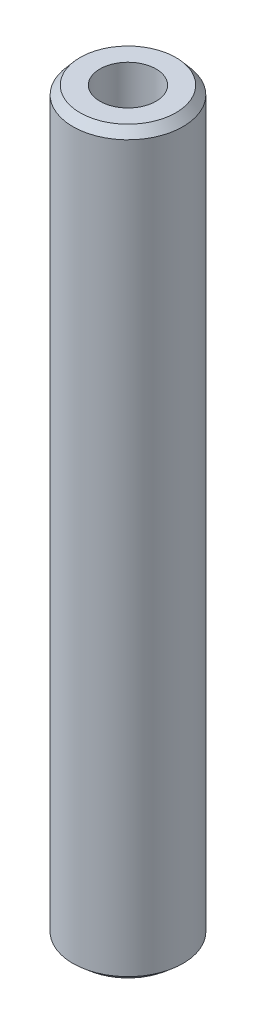
ISO-10303-21;
HEADER;
FILE_DESCRIPTION(('STEP AP214'),'2;1');
FILE_NAME('part.step','',(''),(''),'','','');
FILE_SCHEMA(('AUTOMOTIVE_DESIGN { 1 0 10303 214 1 1 1 1 }'));
ENDSEC;
DATA;
#1=APPLICATION_CONTEXT('core data for automotive mechanical design processes');
#2=APPLICATION_PROTOCOL_DEFINITION('international standard','automotive_design',2000,#1);
#3=PRODUCT_CONTEXT('',#1,'mechanical');
#4=PRODUCT('Part','Part','',(#3));
#5=PRODUCT_RELATED_PRODUCT_CATEGORY('part','',(#4));
#6=PRODUCT_DEFINITION_FORMATION('','',#4);
#7=PRODUCT_DEFINITION_CONTEXT('part definition',#1,'design');
#8=PRODUCT_DEFINITION('design','',#6,#7);
#9=PRODUCT_DEFINITION_SHAPE('','',#8);
#10=(LENGTH_UNIT() NAMED_UNIT(*) SI_UNIT(.MILLI.,.METRE.));
#11=(NAMED_UNIT(*) PLANE_ANGLE_UNIT() SI_UNIT($,.RADIAN.));
#12=(NAMED_UNIT(*) SI_UNIT($,.STERADIAN.) SOLID_ANGLE_UNIT());
#13=UNCERTAINTY_MEASURE_WITH_UNIT(LENGTH_MEASURE(1.E-05),#10,'distance_accuracy_value','');
#14=(GEOMETRIC_REPRESENTATION_CONTEXT(3) GLOBAL_UNCERTAINTY_ASSIGNED_CONTEXT((#13)) GLOBAL_UNIT_ASSIGNED_CONTEXT((#10,
#11,#12)) REPRESENTATION_CONTEXT('',''));
#15=CARTESIAN_POINT('',(0.,0.,0.));
#16=DIRECTION('',(0.,0.,1.));
#17=DIRECTION('',(1.,0.,0.));
#18=AXIS2_PLACEMENT_3D('',#15,#16,#17);
#19=CARTESIAN_POINT('',(0.,302.458994850044,0.));
#20=DIRECTION('',(0.,-1.,0.));
#21=DIRECTION('',(0.,0.,-1.));
#22=AXIS2_PLACEMENT_3D('',#19,#20,#21);
#23=CYLINDRICAL_SURFACE('',#22,22.5);
#24=CARTESIAN_POINT('',(0.,299.00788047226,0.));
#25=DIRECTION('',(0.,1.,0.));
#26=DIRECTION('',(0.,0.,1.));
#27=AXIS2_PLACEMENT_3D('',#24,#25,#26);
#28=CIRCLE('',#27,22.5);
#29=CARTESIAN_POINT('',(0.,299.00788047226,22.5));
#30=VERTEX_POINT('',#29);
#31=EDGE_CURVE('E50',#30,#30,#28,.F.);
#32=ORIENTED_EDGE('',*,*,#31,.T.);
#33=EDGE_LOOP('',(#32));
#34=FACE_BOUND('',#33,.T.);
#35=CARTESIAN_POINT('',(0.,2.92692691111945,0.));
#36=DIRECTION('',(0.,1.,0.));
#37=DIRECTION('',(0.,0.,1.));
#38=AXIS2_PLACEMENT_3D('',#35,#36,#37);
#39=CIRCLE('',#38,22.5);
#40=CARTESIAN_POINT('',(0.,2.92692691111945,22.5));
#41=VERTEX_POINT('',#40);
#42=EDGE_CURVE('E51',#41,#41,#39,.T.);
#43=ORIENTED_EDGE('',*,*,#42,.T.);
#44=EDGE_LOOP('',(#43));
#45=FACE_BOUND('',#44,.T.);
#46=ADVANCED_FACE('F39',(#34,#45),#23,.T.);
#47=CARTESIAN_POINT('',(0.,302.458994850044,0.));
#48=DIRECTION('',(0.,1.,0.));
#49=DIRECTION('',(0.,0.,1.));
#50=AXIS2_PLACEMENT_3D('',#47,#48,#49);
#51=PLANE('',#50);
#52=CARTESIAN_POINT('',(0.,302.458994850044,0.));
#53=DIRECTION('',(0.,1.,0.));
#54=DIRECTION('',(0.,0.,1.));
#55=AXIS2_PLACEMENT_3D('',#52,#53,#54);
#56=CIRCLE('',#55,19.5730730888806);
#57=CARTESIAN_POINT('',(0.,302.458994850044,19.5730730888806));
#58=VERTEX_POINT('',#57);
#59=EDGE_CURVE('E54',#58,#58,#56,.T.);
#60=ORIENTED_EDGE('',*,*,#59,.T.);
#61=EDGE_LOOP('',(#60));
#62=FACE_BOUND('',#61,.T.);
#63=CARTESIAN_POINT('',(0.,302.458994850044,0.));
#64=DIRECTION('',(0.,1.,0.));
#65=DIRECTION('',(0.,0.,1.));
#66=AXIS2_PLACEMENT_3D('',#63,#64,#65);
#67=CIRCLE('',#66,11.4601006637315);
#68=CARTESIAN_POINT('',(0.,302.458994850044,11.4601006637315));
#69=VERTEX_POINT('',#68);
#70=EDGE_CURVE('E58',#69,#69,#67,.T.);
#71=ORIENTED_EDGE('',*,*,#70,.F.);
#72=EDGE_LOOP('',(#71));
#73=FACE_BOUND('',#72,.T.);
#74=ADVANCED_FACE('F69',(#62,#73),#51,.T.);
#75=CARTESIAN_POINT('',(0.,0.,0.));
#76=DIRECTION('',(0.,1.,0.));
#77=DIRECTION('',(0.,0.,1.));
#78=AXIS2_PLACEMENT_3D('',#75,#76,#77);
#79=PLANE('',#78);
#80=CARTESIAN_POINT('',(0.,0.,0.));
#81=DIRECTION('',(0.,1.,0.));
#82=DIRECTION('',(0.,0.,1.));
#83=AXIS2_PLACEMENT_3D('',#80,#81,#82);
#84=CIRCLE('',#83,19.0488856222162);
#85=CARTESIAN_POINT('',(0.,0.,19.0488856222162));
#86=VERTEX_POINT('',#85);
#87=EDGE_CURVE('E10',#86,#86,#84,.F.);
#88=ORIENTED_EDGE('',*,*,#87,.T.);
#89=EDGE_LOOP('',(#88));
#90=FACE_BOUND('',#89,.T.);
#91=CARTESIAN_POINT('',(0.,0.,0.));
#92=DIRECTION('',(0.,1.,0.));
#93=DIRECTION('',(0.,0.,1.));
#94=AXIS2_PLACEMENT_3D('',#91,#92,#93);
#95=CIRCLE('',#94,11.4601006637315);
#96=CARTESIAN_POINT('',(0.,0.,11.4601006637315));
#97=VERTEX_POINT('',#96);
#98=EDGE_CURVE('E63',#97,#97,#95,.T.);
#99=ORIENTED_EDGE('',*,*,#98,.T.);
#100=EDGE_LOOP('',(#99));
#101=FACE_BOUND('',#100,.T.);
#102=ADVANCED_FACE('F75',(#90,#101),#79,.F.);
#103=CARTESIAN_POINT('',(0.,302.458994850044,0.));
#104=DIRECTION('',(0.,-1.,0.));
#105=DIRECTION('',(0.,0.,-1.));
#106=AXIS2_PLACEMENT_3D('',#103,#104,#105);
#107=CYLINDRICAL_SURFACE('',#106,11.4601006637315);
#108=ORIENTED_EDGE('',*,*,#70,.T.);
#109=EDGE_LOOP('',(#108));
#110=FACE_BOUND('',#109,.T.);
#111=ORIENTED_EDGE('',*,*,#98,.F.);
#112=EDGE_LOOP('',(#111));
#113=FACE_BOUND('',#112,.T.);
#114=ADVANCED_FACE('F70',(#110,#113),#107,.F.);
#115=CARTESIAN_POINT('',(0.,302.458994850044,0.));
#116=DIRECTION('',(0.,-1.,0.));
#117=DIRECTION('',(0.,0.,-1.));
#118=AXIS2_PLACEMENT_3D('',#115,#116,#117);
#119=CONICAL_SURFACE('',#118,19.5730730888806,0.703396184985723);
#120=ORIENTED_EDGE('',*,*,#31,.F.);
#121=EDGE_LOOP('',(#120));
#122=FACE_BOUND('',#121,.T.);
#123=ORIENTED_EDGE('',*,*,#59,.F.);
#124=EDGE_LOOP('',(#123));
#125=FACE_BOUND('',#124,.T.);
#126=ADVANCED_FACE('F81',(#122,#125),#119,.T.);
#127=CARTESIAN_POINT('',(0.,2.92692691111945,0.));
#128=DIRECTION('',(0.,1.,0.));
#129=DIRECTION('',(0.,0.,1.));
#130=AXIS2_PLACEMENT_3D('',#127,#128,#129);
#131=CONICAL_SURFACE('',#130,22.5,0.867400141809176);
#132=ORIENTED_EDGE('',*,*,#87,.F.);
#133=EDGE_LOOP('',(#132));
#134=FACE_BOUND('',#133,.T.);
#135=ORIENTED_EDGE('',*,*,#42,.F.);
#136=EDGE_LOOP('',(#135));
#137=FACE_BOUND('',#136,.T.);
#138=ADVANCED_FACE('F45',(#134,#137),#131,.T.);
#139=CLOSED_SHELL('',(#46,#74,#102,#114,#126,#138));
#140=MANIFOLD_SOLID_BREP('B2',#139);
#141=ADVANCED_BREP_SHAPE_REPRESENTATION('',(#18,#140),#14);
#142=SHAPE_DEFINITION_REPRESENTATION(#9,#141);
ENDSEC;
END-ISO-10303-21;
